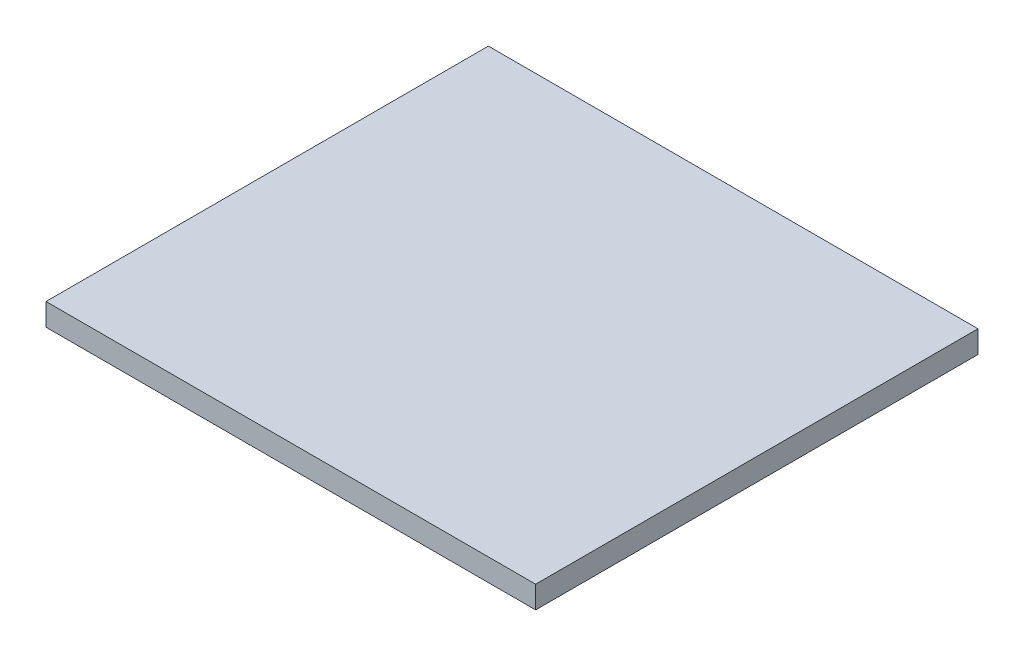
ISO-10303-21;
HEADER;
FILE_DESCRIPTION(('STEP AP214'),'2;1');
FILE_NAME('part.step','',(''),(''),'','','');
FILE_SCHEMA(('AUTOMOTIVE_DESIGN { 1 0 10303 214 1 1 1 1 }'));
ENDSEC;
DATA;
#1=APPLICATION_CONTEXT('core data for automotive mechanical design processes');
#2=APPLICATION_PROTOCOL_DEFINITION('international standard','automotive_design',2000,#1);
#3=PRODUCT_CONTEXT('',#1,'mechanical');
#4=PRODUCT('Part','Part','',(#3));
#5=PRODUCT_RELATED_PRODUCT_CATEGORY('part','',(#4));
#6=PRODUCT_DEFINITION_FORMATION('','',#4);
#7=PRODUCT_DEFINITION_CONTEXT('part definition',#1,'design');
#8=PRODUCT_DEFINITION('design','',#6,#7);
#9=PRODUCT_DEFINITION_SHAPE('','',#8);
#10=(LENGTH_UNIT() NAMED_UNIT(*) SI_UNIT(.MILLI.,.METRE.));
#11=(NAMED_UNIT(*) PLANE_ANGLE_UNIT() SI_UNIT($,.RADIAN.));
#12=(NAMED_UNIT(*) SI_UNIT($,.STERADIAN.) SOLID_ANGLE_UNIT());
#13=UNCERTAINTY_MEASURE_WITH_UNIT(LENGTH_MEASURE(1.E-05),#10,'distance_accuracy_value','');
#14=(GEOMETRIC_REPRESENTATION_CONTEXT(3) GLOBAL_UNCERTAINTY_ASSIGNED_CONTEXT((#13)) GLOBAL_UNIT_ASSIGNED_CONTEXT((#10,
#11,#12)) REPRESENTATION_CONTEXT('',''));
#15=CARTESIAN_POINT('',(0.,0.,0.));
#16=DIRECTION('',(0.,0.,1.));
#17=DIRECTION('',(1.,0.,0.));
#18=AXIS2_PLACEMENT_3D('',#15,#16,#17);
#19=CARTESIAN_POINT('',(-62.4198454926752,6.35,54.6641797552599));
#20=DIRECTION('',(1.,0.,0.));
#21=DIRECTION('',(0.,0.,-1.));
#22=AXIS2_PLACEMENT_3D('',#19,#20,#21);
#23=PLANE('',#22);
#24=DIRECTION('',(0.,0.,1.));
#25=VECTOR('',#24,1.);
#26=CARTESIAN_POINT('',(-62.4198454926752,0.,54.6641797552599));
#27=LINE('',#26,#25);
#28=CARTESIAN_POINT('',(-62.4198454926752,0.,-71.3198202447401));
#29=VERTEX_POINT('',#28);
#30=CARTESIAN_POINT('',(-62.4198454926752,0.,54.6641797552599));
#31=VERTEX_POINT('',#30);
#32=EDGE_CURVE('E95',#29,#31,#27,.T.);
#33=ORIENTED_EDGE('',*,*,#32,.T.);
#34=DIRECTION('',(0.,-1.,0.));
#35=VECTOR('',#34,1.);
#36=CARTESIAN_POINT('',(-62.4198454926752,6.35,54.6641797552599));
#37=LINE('',#36,#35);
#38=CARTESIAN_POINT('',(-62.4198454926752,6.35,54.6641797552599));
#39=VERTEX_POINT('',#38);
#40=EDGE_CURVE('E11',#39,#31,#37,.T.);
#41=ORIENTED_EDGE('',*,*,#40,.F.);
#42=DIRECTION('',(0.,0.,1.));
#43=VECTOR('',#42,1.);
#44=CARTESIAN_POINT('',(-62.4198454926752,6.35,54.6641797552599));
#45=LINE('',#44,#43);
#46=CARTESIAN_POINT('',(-62.4198454926752,6.35,-71.3198202447401));
#47=VERTEX_POINT('',#46);
#48=EDGE_CURVE('E83',#47,#39,#45,.T.);
#49=ORIENTED_EDGE('',*,*,#48,.F.);
#50=DIRECTION('',(0.,-1.,0.));
#51=VECTOR('',#50,1.);
#52=CARTESIAN_POINT('',(-62.4198454926752,6.35,-71.3198202447401));
#53=LINE('',#52,#51);
#54=EDGE_CURVE('E91',#47,#29,#53,.T.);
#55=ORIENTED_EDGE('',*,*,#54,.T.);
#56=EDGE_LOOP('',(#33,#41,#49,#55));
#57=FACE_BOUND('',#56,.T.);
#58=ADVANCED_FACE('F32',(#57),#23,.F.);
#59=CARTESIAN_POINT('',(-62.4198454926752,6.35,54.6641797552599));
#60=DIRECTION('',(0.,0.,-1.));
#61=DIRECTION('',(-1.,0.,0.));
#62=AXIS2_PLACEMENT_3D('',#59,#60,#61);
#63=PLANE('',#62);
#64=DIRECTION('',(1.,0.,0.));
#65=VECTOR('',#64,1.);
#66=CARTESIAN_POINT('',(-62.4198454926752,0.,54.6641797552599));
#67=LINE('',#66,#65);
#68=CARTESIAN_POINT('',(77.0261545073248,0.,54.6641797552599));
#69=VERTEX_POINT('',#68);
#70=EDGE_CURVE('E87',#31,#69,#67,.T.);
#71=ORIENTED_EDGE('',*,*,#70,.T.);
#72=DIRECTION('',(0.,-1.,0.));
#73=VECTOR('',#72,1.);
#74=CARTESIAN_POINT('',(77.0261545073248,6.35,54.6641797552599));
#75=LINE('',#74,#73);
#76=CARTESIAN_POINT('',(77.0261545073248,6.35,54.6641797552599));
#77=VERTEX_POINT('',#76);
#78=EDGE_CURVE('E40',#77,#69,#75,.T.);
#79=ORIENTED_EDGE('',*,*,#78,.F.);
#80=DIRECTION('',(1.,0.,0.));
#81=VECTOR('',#80,1.);
#82=CARTESIAN_POINT('',(-62.4198454926752,6.35,54.6641797552599));
#83=LINE('',#82,#81);
#84=EDGE_CURVE('E78',#39,#77,#83,.T.);
#85=ORIENTED_EDGE('',*,*,#84,.F.);
#86=ORIENTED_EDGE('',*,*,#40,.T.);
#87=EDGE_LOOP('',(#71,#79,#85,#86));
#88=FACE_BOUND('',#87,.T.);
#89=ADVANCED_FACE('F86',(#88),#63,.F.);
#90=CARTESIAN_POINT('',(77.0261545073248,6.35,54.6641797552599));
#91=DIRECTION('',(-1.,0.,0.));
#92=DIRECTION('',(0.,0.,1.));
#93=AXIS2_PLACEMENT_3D('',#90,#91,#92);
#94=PLANE('',#93);
#95=DIRECTION('',(0.,0.,-1.));
#96=VECTOR('',#95,1.);
#97=CARTESIAN_POINT('',(77.0261545073248,0.,54.6641797552599));
#98=LINE('',#97,#96);
#99=CARTESIAN_POINT('',(77.0261545073248,0.,-71.3198202447401));
#100=VERTEX_POINT('',#99);
#101=EDGE_CURVE('E65',#69,#100,#98,.T.);
#102=ORIENTED_EDGE('',*,*,#101,.T.);
#103=DIRECTION('',(0.,-1.,0.));
#104=VECTOR('',#103,1.);
#105=CARTESIAN_POINT('',(77.0261545073248,6.35,-71.3198202447401));
#106=LINE('',#105,#104);
#107=CARTESIAN_POINT('',(77.0261545073248,6.35,-71.3198202447401));
#108=VERTEX_POINT('',#107);
#109=EDGE_CURVE('E88',#108,#100,#106,.T.);
#110=ORIENTED_EDGE('',*,*,#109,.F.);
#111=DIRECTION('',(0.,0.,-1.));
#112=VECTOR('',#111,1.);
#113=CARTESIAN_POINT('',(77.0261545073248,6.35,54.6641797552599));
#114=LINE('',#113,#112);
#115=EDGE_CURVE('E81',#77,#108,#114,.T.);
#116=ORIENTED_EDGE('',*,*,#115,.F.);
#117=ORIENTED_EDGE('',*,*,#78,.T.);
#118=EDGE_LOOP('',(#102,#110,#116,#117));
#119=FACE_BOUND('',#118,.T.);
#120=ADVANCED_FACE('F89',(#119),#94,.F.);
#121=CARTESIAN_POINT('',(-62.4198454926752,6.35,-71.3198202447401));
#122=DIRECTION('',(0.,0.,1.));
#123=DIRECTION('',(1.,0.,0.));
#124=AXIS2_PLACEMENT_3D('',#121,#122,#123);
#125=PLANE('',#124);
#126=DIRECTION('',(-1.,0.,0.));
#127=VECTOR('',#126,1.);
#128=CARTESIAN_POINT('',(-62.4198454926752,0.,-71.3198202447401));
#129=LINE('',#128,#127);
#130=EDGE_CURVE('E71',#100,#29,#129,.T.);
#131=ORIENTED_EDGE('',*,*,#130,.T.);
#132=ORIENTED_EDGE('',*,*,#54,.F.);
#133=DIRECTION('',(-1.,0.,0.));
#134=VECTOR('',#133,1.);
#135=CARTESIAN_POINT('',(-62.4198454926752,6.35,-71.3198202447401));
#136=LINE('',#135,#134);
#137=EDGE_CURVE('E48',#108,#47,#136,.T.);
#138=ORIENTED_EDGE('',*,*,#137,.F.);
#139=ORIENTED_EDGE('',*,*,#109,.T.);
#140=EDGE_LOOP('',(#131,#132,#138,#139));
#141=FACE_BOUND('',#140,.T.);
#142=ADVANCED_FACE('F102',(#141),#125,.F.);
#143=CARTESIAN_POINT('',(0.,6.35,0.));
#144=DIRECTION('',(0.,-1.,0.));
#145=DIRECTION('',(0.,0.,-1.));
#146=AXIS2_PLACEMENT_3D('',#143,#144,#145);
#147=PLANE('',#146);
#148=ORIENTED_EDGE('',*,*,#48,.T.);
#149=ORIENTED_EDGE('',*,*,#84,.T.);
#150=ORIENTED_EDGE('',*,*,#115,.T.);
#151=ORIENTED_EDGE('',*,*,#137,.T.);
#152=EDGE_LOOP('',(#148,#149,#150,#151));
#153=FACE_BOUND('',#152,.T.);
#154=ADVANCED_FACE('F79',(#153),#147,.F.);
#155=CARTESIAN_POINT('',(0.,0.,0.));
#156=DIRECTION('',(0.,-1.,0.));
#157=DIRECTION('',(0.,0.,-1.));
#158=AXIS2_PLACEMENT_3D('',#155,#156,#157);
#159=PLANE('',#158);
#160=ORIENTED_EDGE('',*,*,#32,.F.);
#161=ORIENTED_EDGE('',*,*,#130,.F.);
#162=ORIENTED_EDGE('',*,*,#101,.F.);
#163=ORIENTED_EDGE('',*,*,#70,.F.);
#164=EDGE_LOOP('',(#160,#161,#162,#163));
#165=FACE_BOUND('',#164,.T.);
#166=ADVANCED_FACE('F105',(#165),#159,.T.);
#167=CLOSED_SHELL('',(#58,#89,#120,#142,#154,#166));
#168=MANIFOLD_SOLID_BREP('B2',#167);
#169=ADVANCED_BREP_SHAPE_REPRESENTATION('',(#18,#168),#14);
#170=SHAPE_DEFINITION_REPRESENTATION(#9,#169);
ENDSEC;
END-ISO-10303-21;
